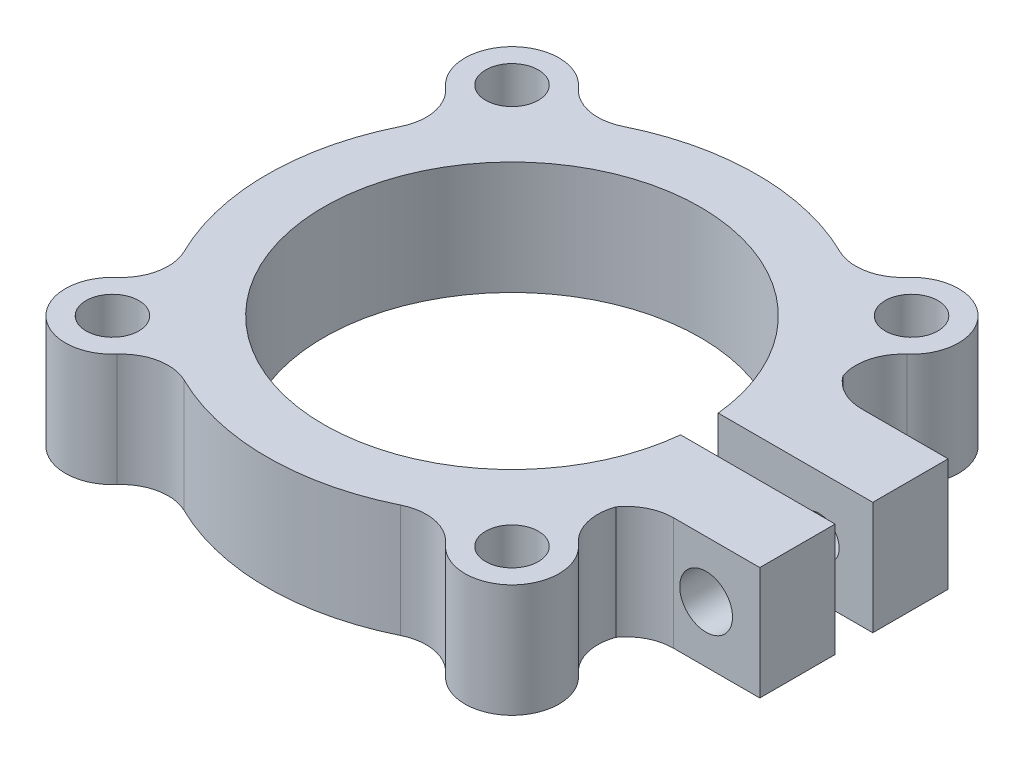
ISO-10303-21;
HEADER;
FILE_DESCRIPTION(('STEP AP214'),'2;1');
FILE_NAME('part.step','',(''),(''),'','','');
FILE_SCHEMA(('AUTOMOTIVE_DESIGN { 1 0 10303 214 1 1 1 1 }'));
ENDSEC;
DATA;
#1=APPLICATION_CONTEXT('core data for automotive mechanical design processes');
#2=APPLICATION_PROTOCOL_DEFINITION('international standard','automotive_design',2000,#1);
#3=PRODUCT_CONTEXT('',#1,'mechanical');
#4=PRODUCT('Part','Part','',(#3));
#5=PRODUCT_RELATED_PRODUCT_CATEGORY('part','',(#4));
#6=PRODUCT_DEFINITION_FORMATION('','',#4);
#7=PRODUCT_DEFINITION_CONTEXT('part definition',#1,'design');
#8=PRODUCT_DEFINITION('design','',#6,#7);
#9=PRODUCT_DEFINITION_SHAPE('','',#8);
#10=(LENGTH_UNIT() NAMED_UNIT(*) SI_UNIT(.MILLI.,.METRE.));
#11=(NAMED_UNIT(*) PLANE_ANGLE_UNIT() SI_UNIT($,.RADIAN.));
#12=(NAMED_UNIT(*) SI_UNIT($,.STERADIAN.) SOLID_ANGLE_UNIT());
#13=UNCERTAINTY_MEASURE_WITH_UNIT(LENGTH_MEASURE(1.E-05),#10,'distance_accuracy_value','');
#14=(GEOMETRIC_REPRESENTATION_CONTEXT(3) GLOBAL_UNCERTAINTY_ASSIGNED_CONTEXT((#13)) GLOBAL_UNIT_ASSIGNED_CONTEXT((#10,
#11,#12)) REPRESENTATION_CONTEXT('',''));
#15=CARTESIAN_POINT('',(0.,0.,0.));
#16=DIRECTION('',(0.,0.,1.));
#17=DIRECTION('',(1.,0.,0.));
#18=AXIS2_PLACEMENT_3D('',#15,#16,#17);
#19=CARTESIAN_POINT('',(19.4387931912541,3.81,6.35));
#20=DIRECTION('',(0.,0.,1.));
#21=DIRECTION('',(1.,0.,0.));
#22=AXIS2_PLACEMENT_3D('',#19,#20,#21);
#23=CYLINDRICAL_SURFACE('',#22,1.77799999999999);
#24=CARTESIAN_POINT('',(19.4387931912541,3.81,1.27));
#25=DIRECTION('',(0.,0.,1.));
#26=DIRECTION('',(1.,0.,0.));
#27=AXIS2_PLACEMENT_3D('',#24,#25,#26);
#28=CIRCLE('',#27,1.77799999999999);
#29=CARTESIAN_POINT('',(21.2167931912541,3.81,1.27));
#30=VERTEX_POINT('',#29);
#31=EDGE_CURVE('E226',#30,#30,#28,.T.);
#32=ORIENTED_EDGE('',*,*,#31,.F.);
#33=EDGE_LOOP('',(#32));
#34=FACE_BOUND('',#33,.T.);
#35=CARTESIAN_POINT('',(19.4387931912541,3.81,6.35000000000001));
#36=DIRECTION('',(0.,0.,1.));
#37=DIRECTION('',(1.,0.,0.));
#38=AXIS2_PLACEMENT_3D('',#35,#36,#37);
#39=CIRCLE('',#38,1.77799999999999);
#40=CARTESIAN_POINT('',(21.2167931912541,3.81,6.35000000000001));
#41=VERTEX_POINT('',#40);
#42=EDGE_CURVE('E231',#41,#41,#39,.F.);
#43=ORIENTED_EDGE('',*,*,#42,.F.);
#44=EDGE_LOOP('',(#43));
#45=FACE_BOUND('',#44,.T.);
#46=ADVANCED_FACE('F17',(#34,#45),#23,.F.);
#47=CARTESIAN_POINT('',(19.4387931912541,3.81,6.35));
#48=DIRECTION('',(0.,0.,1.));
#49=DIRECTION('',(1.,0.,0.));
#50=AXIS2_PLACEMENT_3D('',#47,#48,#49);
#51=CYLINDRICAL_SURFACE('',#50,1.35254999999999);
#52=CARTESIAN_POINT('',(19.4387931912541,3.81,-1.27));
#53=DIRECTION('',(0.,0.,1.));
#54=DIRECTION('',(1.,0.,0.));
#55=AXIS2_PLACEMENT_3D('',#52,#53,#54);
#56=CIRCLE('',#55,1.35254999999999);
#57=CARTESIAN_POINT('',(20.7913431912541,3.81,-1.27));
#58=VERTEX_POINT('',#57);
#59=EDGE_CURVE('E218',#58,#58,#56,.F.);
#60=ORIENTED_EDGE('',*,*,#59,.F.);
#61=EDGE_LOOP('',(#60));
#62=FACE_BOUND('',#61,.T.);
#63=CARTESIAN_POINT('',(19.4387931912541,3.81,-6.35));
#64=DIRECTION('',(0.,0.,1.));
#65=DIRECTION('',(1.,0.,0.));
#66=AXIS2_PLACEMENT_3D('',#63,#64,#65);
#67=CIRCLE('',#66,1.35254999999999);
#68=CARTESIAN_POINT('',(20.7913431912541,3.81,-6.35));
#69=VERTEX_POINT('',#68);
#70=EDGE_CURVE('E20',#69,#69,#67,.T.);
#71=ORIENTED_EDGE('',*,*,#70,.F.);
#72=EDGE_LOOP('',(#71));
#73=FACE_BOUND('',#72,.T.);
#74=ADVANCED_FACE('F736',(#62,#73),#51,.F.);
#75=CARTESIAN_POINT('',(0.,7.62,0.));
#76=DIRECTION('',(0.,1.,0.));
#77=DIRECTION('',(0.,0.,1.));
#78=AXIS2_PLACEMENT_3D('',#75,#76,#77);
#79=PLANE('',#78);
#80=CARTESIAN_POINT('',(13.4703841816036,7.62,-13.4703841816037));
#81=DIRECTION('',(0.,1.,0.));
#82=DIRECTION('',(0.,0.,1.));
#83=AXIS2_PLACEMENT_3D('',#80,#81,#82);
#84=CIRCLE('',#83,1.77799999999999);
#85=CARTESIAN_POINT('',(13.4703841816036,7.62,-11.6923841816037));
#86=VERTEX_POINT('',#85);
#87=EDGE_CURVE('E204',#86,#86,#84,.F.);
#88=ORIENTED_EDGE('',*,*,#87,.T.);
#89=EDGE_LOOP('',(#88));
#90=FACE_BOUND('',#89,.T.);
#91=CARTESIAN_POINT('',(-13.4703841816038,7.62,-13.4703841816036));
#92=DIRECTION('',(0.,1.,0.));
#93=DIRECTION('',(0.,0.,1.));
#94=AXIS2_PLACEMENT_3D('',#91,#92,#93);
#95=CIRCLE('',#94,1.77799999999999);
#96=CARTESIAN_POINT('',(-13.4703841816038,7.62,-11.6923841816036));
#97=VERTEX_POINT('',#96);
#98=EDGE_CURVE('E208',#97,#97,#95,.F.);
#99=ORIENTED_EDGE('',*,*,#98,.T.);
#100=EDGE_LOOP('',(#99));
#101=FACE_BOUND('',#100,.T.);
#102=CARTESIAN_POINT('',(-13.4703841816036,7.62,13.4703841816037));
#103=DIRECTION('',(0.,1.,0.));
#104=DIRECTION('',(0.,0.,1.));
#105=AXIS2_PLACEMENT_3D('',#102,#103,#104);
#106=CIRCLE('',#105,1.77799999999999);
#107=CARTESIAN_POINT('',(-13.4703841816036,7.62,15.2483841816037));
#108=VERTEX_POINT('',#107);
#109=EDGE_CURVE('E211',#108,#108,#106,.F.);
#110=ORIENTED_EDGE('',*,*,#109,.T.);
#111=EDGE_LOOP('',(#110));
#112=FACE_BOUND('',#111,.T.);
#113=CARTESIAN_POINT('',(13.4703841816039,7.62,13.4703841816035));
#114=DIRECTION('',(0.,1.,0.));
#115=DIRECTION('',(0.,0.,1.));
#116=AXIS2_PLACEMENT_3D('',#113,#114,#115);
#117=CIRCLE('',#116,1.77799999999999);
#118=CARTESIAN_POINT('',(13.4703841816039,7.62,15.2483841816035));
#119=VERTEX_POINT('',#118);
#120=EDGE_CURVE('E214',#119,#119,#117,.F.);
#121=ORIENTED_EDGE('',*,*,#120,.T.);
#122=EDGE_LOOP('',(#121));
#123=FACE_BOUND('',#122,.T.);
#124=DIRECTION('',(-1.,0.,0.));
#125=VECTOR('',#124,1.);
#126=CARTESIAN_POINT('',(23.0579604512541,7.62,1.27));
#127=LINE('',#126,#125);
#128=CARTESIAN_POINT('',(12.6363404512541,7.62,1.27));
#129=VERTEX_POINT('',#128);
#130=CARTESIAN_POINT('',(23.0579604512541,7.62,1.27));
#131=VERTEX_POINT('',#130);
#132=EDGE_CURVE('E229',#129,#131,#127,.F.);
#133=ORIENTED_EDGE('',*,*,#132,.F.);
#134=CARTESIAN_POINT('',(0.,7.62,0.));
#135=DIRECTION('',(0.,-1.,0.));
#136=DIRECTION('',(0.,0.,-1.));
#137=AXIS2_PLACEMENT_3D('',#134,#135,#136);
#138=CIRCLE('',#137,12.7);
#139=CARTESIAN_POINT('',(12.6363404512541,7.62,-1.27));
#140=VERTEX_POINT('',#139);
#141=EDGE_CURVE('E222',#129,#140,#138,.T.);
#142=ORIENTED_EDGE('',*,*,#141,.T.);
#143=DIRECTION('',(1.,0.,0.));
#144=VECTOR('',#143,1.);
#145=CARTESIAN_POINT('',(23.0579604512541,7.62,-1.27));
#146=LINE('',#145,#144);
#147=CARTESIAN_POINT('',(23.0579604512541,7.62,-1.27));
#148=VERTEX_POINT('',#147);
#149=EDGE_CURVE('E221',#148,#140,#146,.F.);
#150=ORIENTED_EDGE('',*,*,#149,.F.);
#151=DIRECTION('',(0.,0.,-1.));
#152=VECTOR('',#151,1.);
#153=CARTESIAN_POINT('',(23.0579604512541,7.62,-1.27));
#154=LINE('',#153,#152);
#155=CARTESIAN_POINT('',(23.0579604512541,7.62,-6.35));
#156=VERTEX_POINT('',#155);
#157=EDGE_CURVE('E305',#156,#148,#154,.F.);
#158=ORIENTED_EDGE('',*,*,#157,.F.);
#159=DIRECTION('',(-1.,0.,0.));
#160=VECTOR('',#159,1.);
#161=CARTESIAN_POINT('',(23.0579604512541,7.62,-6.35));
#162=LINE('',#161,#160);
#163=CARTESIAN_POINT('',(17.2271181571382,7.62,-6.35));
#164=VERTEX_POINT('',#163);
#165=EDGE_CURVE('E299',#164,#156,#162,.F.);
#166=ORIENTED_EDGE('',*,*,#165,.F.);
#167=CARTESIAN_POINT('',(17.2271181571382,7.62,-9.525));
#168=DIRECTION('',(0.,-1.,0.));
#169=DIRECTION('',(0.,0.,-1.));
#170=AXIS2_PLACEMENT_3D('',#167,#168,#169);
#171=CIRCLE('',#170,3.175);
#172=CARTESIAN_POINT('',(14.6594904855866,7.62,-7.65740444949055));
#173=VERTEX_POINT('',#172);
#174=EDGE_CURVE('E285',#164,#173,#171,.T.);
#175=ORIENTED_EDGE('',*,*,#174,.T.);
#176=CARTESIAN_POINT('',(17.6591584825056,7.62,-8.69789323283242));
#177=DIRECTION('',(0.,1.,0.));
#178=DIRECTION('',(0.,0.,1.));
#179=AXIS2_PLACEMENT_3D('',#176,#177,#178);
#180=CIRCLE('',#179,3.175);
#181=CARTESIAN_POINT('',(15.5647713320546,7.62,-11.0841387072181));
#182=VERTEX_POINT('',#181);
#183=EDGE_CURVE('E282',#173,#182,#180,.F.);
#184=ORIENTED_EDGE('',*,*,#183,.T.);
#185=CARTESIAN_POINT('',(13.4703841816037,7.62,-13.4703841816038));
#186=DIRECTION('',(0.,-1.,0.));
#187=DIRECTION('',(0.,0.,-1.));
#188=AXIS2_PLACEMENT_3D('',#185,#186,#187);
#189=CIRCLE('',#188,3.17500000000001);
#190=CARTESIAN_POINT('',(11.084138707218,7.62,-15.5647713320547));
#191=VERTEX_POINT('',#190);
#192=EDGE_CURVE('E279',#191,#182,#189,.T.);
#193=ORIENTED_EDGE('',*,*,#192,.F.);
#194=CARTESIAN_POINT('',(8.69789323283236,7.62,-17.6591584825056));
#195=DIRECTION('',(0.,1.,0.));
#196=DIRECTION('',(0.,0.,1.));
#197=AXIS2_PLACEMENT_3D('',#194,#195,#196);
#198=CIRCLE('',#197,3.175);
#199=CARTESIAN_POINT('',(7.29500722753681,7.62,-14.8109071143595));
#200=VERTEX_POINT('',#199);
#201=EDGE_CURVE('E183',#191,#200,#198,.F.);
#202=ORIENTED_EDGE('',*,*,#201,.T.);
#203=CARTESIAN_POINT('',(0.,7.62,0.));
#204=DIRECTION('',(0.,-1.,0.));
#205=DIRECTION('',(0.,0.,-1.));
#206=AXIS2_PLACEMENT_3D('',#203,#204,#205);
#207=CIRCLE('',#206,16.51);
#208=CARTESIAN_POINT('',(-7.29500722753686,7.62,-14.8109071143595));
#209=VERTEX_POINT('',#208);
#210=EDGE_CURVE('E182',#209,#200,#207,.T.);
#211=ORIENTED_EDGE('',*,*,#210,.F.);
#212=CARTESIAN_POINT('',(-8.6978932328324,7.62,-17.6591584825056));
#213=DIRECTION('',(0.,1.,0.));
#214=DIRECTION('',(0.,0.,1.));
#215=AXIS2_PLACEMENT_3D('',#212,#213,#214);
#216=CIRCLE('',#215,3.175);
#217=CARTESIAN_POINT('',(-11.0841387072181,7.62,-15.5647713320546));
#218=VERTEX_POINT('',#217);
#219=EDGE_CURVE('E273',#209,#218,#216,.F.);
#220=ORIENTED_EDGE('',*,*,#219,.T.);
#221=CARTESIAN_POINT('',(-13.4703841816037,7.62,-13.4703841816037));
#222=DIRECTION('',(0.,-1.,0.));
#223=DIRECTION('',(0.,0.,-1.));
#224=AXIS2_PLACEMENT_3D('',#221,#222,#223);
#225=CIRCLE('',#224,3.17500000000001);
#226=CARTESIAN_POINT('',(-15.5647713320547,7.62,-11.084138707218));
#227=VERTEX_POINT('',#226);
#228=EDGE_CURVE('E270',#227,#218,#225,.T.);
#229=ORIENTED_EDGE('',*,*,#228,.F.);
#230=CARTESIAN_POINT('',(-17.6591584825056,7.62,-8.69789323283237));
#231=DIRECTION('',(0.,1.,0.));
#232=DIRECTION('',(0.,0.,1.));
#233=AXIS2_PLACEMENT_3D('',#230,#231,#232);
#234=CIRCLE('',#233,3.175);
#235=CARTESIAN_POINT('',(-14.8109071143595,7.62,-7.29500722753683));
#236=VERTEX_POINT('',#235);
#237=EDGE_CURVE('E266',#227,#236,#234,.F.);
#238=ORIENTED_EDGE('',*,*,#237,.T.);
#239=CARTESIAN_POINT('',(0.,7.62,0.));
#240=DIRECTION('',(0.,-1.,0.));
#241=DIRECTION('',(0.,0.,-1.));
#242=AXIS2_PLACEMENT_3D('',#239,#240,#241);
#243=CIRCLE('',#242,16.51);
#244=CARTESIAN_POINT('',(-14.8109071143595,7.62,7.29500722753685));
#245=VERTEX_POINT('',#244);
#246=EDGE_CURVE('E263',#245,#236,#243,.T.);
#247=ORIENTED_EDGE('',*,*,#246,.F.);
#248=CARTESIAN_POINT('',(-17.6591584825056,7.62,8.6978932328324));
#249=DIRECTION('',(0.,1.,0.));
#250=DIRECTION('',(0.,0.,1.));
#251=AXIS2_PLACEMENT_3D('',#248,#249,#250);
#252=CIRCLE('',#251,3.175);
#253=CARTESIAN_POINT('',(-15.5647713320547,7.62,11.0841387072181));
#254=VERTEX_POINT('',#253);
#255=EDGE_CURVE('E259',#245,#254,#252,.F.);
#256=ORIENTED_EDGE('',*,*,#255,.T.);
#257=CARTESIAN_POINT('',(-13.4703841816037,7.62,13.4703841816037));
#258=DIRECTION('',(0.,-1.,0.));
#259=DIRECTION('',(0.,0.,-1.));
#260=AXIS2_PLACEMENT_3D('',#257,#258,#259);
#261=CIRCLE('',#260,3.17500000000001);
#262=CARTESIAN_POINT('',(-11.0841387072181,7.62,15.5647713320547));
#263=VERTEX_POINT('',#262);
#264=EDGE_CURVE('E256',#263,#254,#261,.T.);
#265=ORIENTED_EDGE('',*,*,#264,.F.);
#266=CARTESIAN_POINT('',(-8.69789323283238,7.62,17.6591584825056));
#267=DIRECTION('',(0.,1.,0.));
#268=DIRECTION('',(0.,0.,1.));
#269=AXIS2_PLACEMENT_3D('',#266,#267,#268);
#270=CIRCLE('',#269,3.175);
#271=CARTESIAN_POINT('',(-7.29500722753683,7.62,14.8109071143595));
#272=VERTEX_POINT('',#271);
#273=EDGE_CURVE('E252',#263,#272,#270,.F.);
#274=ORIENTED_EDGE('',*,*,#273,.T.);
#275=CARTESIAN_POINT('',(0.,7.62,0.));
#276=DIRECTION('',(0.,-1.,0.));
#277=DIRECTION('',(0.,0.,-1.));
#278=AXIS2_PLACEMENT_3D('',#275,#276,#277);
#279=CIRCLE('',#278,16.51);
#280=CARTESIAN_POINT('',(7.29500722753684,7.62,14.8109071143595));
#281=VERTEX_POINT('',#280);
#282=EDGE_CURVE('E249',#281,#272,#279,.T.);
#283=ORIENTED_EDGE('',*,*,#282,.F.);
#284=CARTESIAN_POINT('',(8.69789323283239,7.62,17.6591584825056));
#285=DIRECTION('',(0.,1.,0.));
#286=DIRECTION('',(0.,0.,1.));
#287=AXIS2_PLACEMENT_3D('',#284,#285,#286);
#288=CIRCLE('',#287,3.175);
#289=CARTESIAN_POINT('',(11.0841387072181,7.62,15.5647713320547));
#290=VERTEX_POINT('',#289);
#291=EDGE_CURVE('E245',#281,#290,#288,.F.);
#292=ORIENTED_EDGE('',*,*,#291,.T.);
#293=CARTESIAN_POINT('',(13.4703841816037,7.62,13.4703841816037));
#294=DIRECTION('',(0.,-1.,0.));
#295=DIRECTION('',(0.,0.,-1.));
#296=AXIS2_PLACEMENT_3D('',#293,#294,#295);
#297=CIRCLE('',#296,3.17500000000001);
#298=CARTESIAN_POINT('',(15.5647713320547,7.62,11.0841387072181));
#299=VERTEX_POINT('',#298);
#300=EDGE_CURVE('E243',#299,#290,#297,.T.);
#301=ORIENTED_EDGE('',*,*,#300,.F.);
#302=CARTESIAN_POINT('',(17.6591584825056,7.62,8.69789323283239));
#303=DIRECTION('',(0.,1.,0.));
#304=DIRECTION('',(0.,0.,1.));
#305=AXIS2_PLACEMENT_3D('',#302,#303,#304);
#306=CIRCLE('',#305,3.175);
#307=CARTESIAN_POINT('',(14.6594904855866,7.62,7.65740444949056));
#308=VERTEX_POINT('',#307);
#309=EDGE_CURVE('E239',#299,#308,#306,.F.);
#310=ORIENTED_EDGE('',*,*,#309,.T.);
#311=CARTESIAN_POINT('',(17.2271181571382,7.62,9.525));
#312=DIRECTION('',(0.,-1.,0.));
#313=DIRECTION('',(0.,0.,-1.));
#314=AXIS2_PLACEMENT_3D('',#311,#312,#313);
#315=CIRCLE('',#314,3.175);
#316=CARTESIAN_POINT('',(17.2271181571382,7.62,6.35));
#317=VERTEX_POINT('',#316);
#318=EDGE_CURVE('E235',#308,#317,#315,.T.);
#319=ORIENTED_EDGE('',*,*,#318,.T.);
#320=DIRECTION('',(1.,0.,0.));
#321=VECTOR('',#320,1.);
#322=CARTESIAN_POINT('',(23.0579604512541,7.62,6.35));
#323=LINE('',#322,#321);
#324=CARTESIAN_POINT('',(23.0579604512541,7.62,6.35));
#325=VERTEX_POINT('',#324);
#326=EDGE_CURVE('E234',#325,#317,#323,.F.);
#327=ORIENTED_EDGE('',*,*,#326,.F.);
#328=DIRECTION('',(0.,0.,-1.));
#329=VECTOR('',#328,1.);
#330=CARTESIAN_POINT('',(23.0579604512541,7.62,1.27));
#331=LINE('',#330,#329);
#332=EDGE_CURVE('E319',#131,#325,#331,.F.);
#333=ORIENTED_EDGE('',*,*,#332,.F.);
#334=EDGE_LOOP('',(#133,#142,#150,#158,#166,#175,#184,#193,#202,#211,#220,#229,#238,#247,#256,
#265,#274,#283,#292,#301,#310,#319,#327,#333));
#335=FACE_BOUND('',#334,.T.);
#336=ADVANCED_FACE('F459',(#90,#101,#112,#123,#335),#79,.T.);
#337=CARTESIAN_POINT('',(23.0579604512541,-11.5938157404885,-1.27));
#338=DIRECTION('',(1.,0.,0.));
#339=DIRECTION('',(0.,0.,-1.));
#340=AXIS2_PLACEMENT_3D('',#337,#338,#339);
#341=PLANE('',#340);
#342=ORIENTED_EDGE('',*,*,#157,.T.);
#343=DIRECTION('',(0.,1.,0.));
#344=VECTOR('',#343,1.);
#345=CARTESIAN_POINT('',(23.0579604512541,-11.5938157404885,-1.27));
#346=LINE('',#345,#344);
#347=CARTESIAN_POINT('',(23.0579604512541,0.,-1.27));
#348=VERTEX_POINT('',#347);
#349=EDGE_CURVE('E217',#348,#148,#346,.T.);
#350=ORIENTED_EDGE('',*,*,#349,.F.);
#351=DIRECTION('',(0.,0.,1.));
#352=VECTOR('',#351,1.);
#353=CARTESIAN_POINT('',(23.0579604512541,0.,0.));
#354=LINE('',#353,#352);
#355=CARTESIAN_POINT('',(23.0579604512541,0.,-6.35));
#356=VERTEX_POINT('',#355);
#357=EDGE_CURVE('E207',#348,#356,#354,.F.);
#358=ORIENTED_EDGE('',*,*,#357,.T.);
#359=DIRECTION('',(0.,1.,0.));
#360=VECTOR('',#359,1.);
#361=CARTESIAN_POINT('',(23.0579604512541,-11.5938157404885,-6.35));
#362=LINE('',#361,#360);
#363=EDGE_CURVE('E293',#156,#356,#362,.F.);
#364=ORIENTED_EDGE('',*,*,#363,.F.);
#365=EDGE_LOOP('',(#342,#350,#358,#364));
#366=FACE_BOUND('',#365,.T.);
#367=ADVANCED_FACE('F720',(#366),#341,.T.);
#368=CARTESIAN_POINT('',(23.0579604512541,-11.5938157404885,-6.35));
#369=DIRECTION('',(0.,0.,-1.));
#370=DIRECTION('',(-1.,0.,0.));
#371=AXIS2_PLACEMENT_3D('',#368,#369,#370);
#372=PLANE('',#371);
#373=ORIENTED_EDGE('',*,*,#165,.T.);
#374=ORIENTED_EDGE('',*,*,#363,.T.);
#375=DIRECTION('',(1.,0.,0.));
#376=VECTOR('',#375,1.);
#377=CARTESIAN_POINT('',(0.,0.,-6.35));
#378=LINE('',#377,#376);
#379=CARTESIAN_POINT('',(17.2271181571382,0.,-6.35));
#380=VERTEX_POINT('',#379);
#381=EDGE_CURVE('E203',#356,#380,#378,.F.);
#382=ORIENTED_EDGE('',*,*,#381,.T.);
#383=DIRECTION('',(0.,-1.,0.));
#384=VECTOR('',#383,1.);
#385=CARTESIAN_POINT('',(17.2271181571382,7.62,-6.35));
#386=LINE('',#385,#384);
#387=EDGE_CURVE('E286',#380,#164,#386,.F.);
#388=ORIENTED_EDGE('',*,*,#387,.T.);
#389=EDGE_LOOP('',(#373,#374,#382,#388));
#390=FACE_BOUND('',#389,.T.);
#391=ORIENTED_EDGE('',*,*,#70,.T.);
#392=EDGE_LOOP('',(#391));
#393=FACE_BOUND('',#392,.T.);
#394=ADVANCED_FACE('F407',(#390,#393),#372,.T.);
#395=CARTESIAN_POINT('',(17.2271181571382,7.62,-9.525));
#396=DIRECTION('',(0.,-1.,0.));
#397=DIRECTION('',(0.,0.,-1.));
#398=AXIS2_PLACEMENT_3D('',#395,#396,#397);
#399=CYLINDRICAL_SURFACE('',#398,3.175);
#400=ORIENTED_EDGE('',*,*,#387,.F.);
#401=CARTESIAN_POINT('',(17.2271181571382,0.,-9.525));
#402=DIRECTION('',(0.,-1.,0.));
#403=DIRECTION('',(0.,0.,-1.));
#404=AXIS2_PLACEMENT_3D('',#401,#402,#403);
#405=CIRCLE('',#404,3.175);
#406=CARTESIAN_POINT('',(14.6594904855866,0.,-7.65740444949055));
#407=VERTEX_POINT('',#406);
#408=EDGE_CURVE('E200',#380,#407,#405,.T.);
#409=ORIENTED_EDGE('',*,*,#408,.T.);
#410=DIRECTION('',(0.,1.,0.));
#411=VECTOR('',#410,1.);
#412=CARTESIAN_POINT('',(14.6594904855866,7.62,-7.65740444949055));
#413=LINE('',#412,#411);
#414=EDGE_CURVE('E284',#407,#173,#413,.T.);
#415=ORIENTED_EDGE('',*,*,#414,.T.);
#416=ORIENTED_EDGE('',*,*,#174,.F.);
#417=EDGE_LOOP('',(#400,#409,#415,#416));
#418=FACE_BOUND('',#417,.T.);
#419=ADVANCED_FACE('F403',(#418),#399,.F.);
#420=CARTESIAN_POINT('',(17.6591584825056,7.62,-8.69789323283242));
#421=DIRECTION('',(0.,1.,0.));
#422=DIRECTION('',(0.,0.,1.));
#423=AXIS2_PLACEMENT_3D('',#420,#421,#422);
#424=CYLINDRICAL_SURFACE('',#423,3.175);
#425=ORIENTED_EDGE('',*,*,#183,.F.);
#426=ORIENTED_EDGE('',*,*,#414,.F.);
#427=CARTESIAN_POINT('',(17.6591584825056,0.,-8.69789323283242));
#428=DIRECTION('',(0.,1.,0.));
#429=DIRECTION('',(0.,0.,1.));
#430=AXIS2_PLACEMENT_3D('',#427,#428,#429);
#431=CIRCLE('',#430,3.175);
#432=CARTESIAN_POINT('',(15.5647713320546,0.,-11.0841387072181));
#433=VERTEX_POINT('',#432);
#434=EDGE_CURVE('E197',#407,#433,#431,.F.);
#435=ORIENTED_EDGE('',*,*,#434,.T.);
#436=DIRECTION('',(0.,-1.,0.));
#437=VECTOR('',#436,1.);
#438=CARTESIAN_POINT('',(15.5647713320546,7.62,-11.0841387072181));
#439=LINE('',#438,#437);
#440=EDGE_CURVE('E281',#182,#433,#439,.T.);
#441=ORIENTED_EDGE('',*,*,#440,.F.);
#442=EDGE_LOOP('',(#425,#426,#435,#441));
#443=FACE_BOUND('',#442,.T.);
#444=ADVANCED_FACE('F401',(#443),#424,.F.);
#445=CARTESIAN_POINT('',(13.4703841816037,7.62,-13.4703841816038));
#446=DIRECTION('',(0.,-1.,0.));
#447=DIRECTION('',(0.,0.,-1.));
#448=AXIS2_PLACEMENT_3D('',#445,#446,#447);
#449=CYLINDRICAL_SURFACE('',#448,3.17500000000001);
#450=CARTESIAN_POINT('',(13.4703841816037,0.,-13.4703841816038));
#451=DIRECTION('',(0.,-1.,0.));
#452=DIRECTION('',(0.,0.,-1.));
#453=AXIS2_PLACEMENT_3D('',#450,#451,#452);
#454=CIRCLE('',#453,3.17500000000001);
#455=CARTESIAN_POINT('',(11.084138707218,0.,-15.5647713320547));
#456=VERTEX_POINT('',#455);
#457=EDGE_CURVE('E177',#433,#456,#454,.F.);
#458=ORIENTED_EDGE('',*,*,#457,.T.);
#459=DIRECTION('',(0.,1.,0.));
#460=VECTOR('',#459,1.);
#461=CARTESIAN_POINT('',(11.084138707218,7.62,-15.5647713320547));
#462=LINE('',#461,#460);
#463=EDGE_CURVE('E174',#456,#191,#462,.T.);
#464=ORIENTED_EDGE('',*,*,#463,.T.);
#465=ORIENTED_EDGE('',*,*,#192,.T.);
#466=ORIENTED_EDGE('',*,*,#440,.T.);
#467=EDGE_LOOP('',(#458,#464,#465,#466));
#468=FACE_BOUND('',#467,.T.);
#469=ADVANCED_FACE('F397',(#468),#449,.T.);
#470=CARTESIAN_POINT('',(8.69789323283236,7.62,-17.6591584825056));
#471=DIRECTION('',(0.,1.,0.));
#472=DIRECTION('',(0.,0.,1.));
#473=AXIS2_PLACEMENT_3D('',#470,#471,#472);
#474=CYLINDRICAL_SURFACE('',#473,3.175);
#475=CARTESIAN_POINT('',(8.69789323283236,0.,-17.6591584825056));
#476=DIRECTION('',(0.,1.,0.));
#477=DIRECTION('',(0.,0.,1.));
#478=AXIS2_PLACEMENT_3D('',#475,#476,#477);
#479=CIRCLE('',#478,3.175);
#480=CARTESIAN_POINT('',(7.29500722753681,0.,-14.8109071143595));
#481=VERTEX_POINT('',#480);
#482=EDGE_CURVE('E169',#456,#481,#479,.F.);
#483=ORIENTED_EDGE('',*,*,#482,.T.);
#484=DIRECTION('',(0.,-1.,0.));
#485=VECTOR('',#484,1.);
#486=CARTESIAN_POINT('',(7.29500722753681,7.62,-14.8109071143595));
#487=LINE('',#486,#485);
#488=EDGE_CURVE('E172',#200,#481,#487,.T.);
#489=ORIENTED_EDGE('',*,*,#488,.F.);
#490=ORIENTED_EDGE('',*,*,#201,.F.);
#491=ORIENTED_EDGE('',*,*,#463,.F.);
#492=EDGE_LOOP('',(#483,#489,#490,#491));
#493=FACE_BOUND('',#492,.T.);
#494=ADVANCED_FACE('F170',(#493),#474,.F.);
#495=CARTESIAN_POINT('',(0.,7.62,0.));
#496=DIRECTION('',(0.,-1.,0.));
#497=DIRECTION('',(0.,0.,-1.));
#498=AXIS2_PLACEMENT_3D('',#495,#496,#497);
#499=CYLINDRICAL_SURFACE('',#498,16.51);
#500=CARTESIAN_POINT('',(0.,0.,0.));
#501=DIRECTION('',(0.,-1.,0.));
#502=DIRECTION('',(0.,0.,-1.));
#503=AXIS2_PLACEMENT_3D('',#500,#501,#502);
#504=CIRCLE('',#503,16.51);
#505=CARTESIAN_POINT('',(-7.29500722753686,0.,-14.8109071143595));
#506=VERTEX_POINT('',#505);
#507=EDGE_CURVE('E162',#481,#506,#504,.F.);
#508=ORIENTED_EDGE('',*,*,#507,.T.);
#509=DIRECTION('',(0.,-1.,0.));
#510=VECTOR('',#509,1.);
#511=CARTESIAN_POINT('',(-7.29500722753686,7.62,-14.8109071143595));
#512=LINE('',#511,#510);
#513=EDGE_CURVE('E276',#506,#209,#512,.F.);
#514=ORIENTED_EDGE('',*,*,#513,.T.);
#515=ORIENTED_EDGE('',*,*,#210,.T.);
#516=ORIENTED_EDGE('',*,*,#488,.T.);
#517=EDGE_LOOP('',(#508,#514,#515,#516));
#518=FACE_BOUND('',#517,.T.);
#519=ADVANCED_FACE('F180',(#518),#499,.T.);
#520=CARTESIAN_POINT('',(-8.6978932328324,7.62,-17.6591584825056));
#521=DIRECTION('',(0.,1.,0.));
#522=DIRECTION('',(0.,0.,1.));
#523=AXIS2_PLACEMENT_3D('',#520,#521,#522);
#524=CYLINDRICAL_SURFACE('',#523,3.175);
#525=CARTESIAN_POINT('',(-8.6978932328324,0.,-17.6591584825056));
#526=DIRECTION('',(0.,1.,0.));
#527=DIRECTION('',(0.,0.,1.));
#528=AXIS2_PLACEMENT_3D('',#525,#526,#527);
#529=CIRCLE('',#528,3.175);
#530=CARTESIAN_POINT('',(-11.0841387072181,0.,-15.5647713320546));
#531=VERTEX_POINT('',#530);
#532=EDGE_CURVE('E189',#506,#531,#529,.F.);
#533=ORIENTED_EDGE('',*,*,#532,.T.);
#534=DIRECTION('',(0.,-1.,0.));
#535=VECTOR('',#534,1.);
#536=CARTESIAN_POINT('',(-11.0841387072181,7.62,-15.5647713320546));
#537=LINE('',#536,#535);
#538=EDGE_CURVE('E272',#218,#531,#537,.T.);
#539=ORIENTED_EDGE('',*,*,#538,.F.);
#540=ORIENTED_EDGE('',*,*,#219,.F.);
#541=ORIENTED_EDGE('',*,*,#513,.F.);
#542=EDGE_LOOP('',(#533,#539,#540,#541));
#543=FACE_BOUND('',#542,.T.);
#544=ADVANCED_FACE('F462',(#543),#524,.F.);
#545=CARTESIAN_POINT('',(-13.4703841816037,7.62,-13.4703841816037));
#546=DIRECTION('',(0.,-1.,0.));
#547=DIRECTION('',(0.,0.,-1.));
#548=AXIS2_PLACEMENT_3D('',#545,#546,#547);
#549=CYLINDRICAL_SURFACE('',#548,3.17500000000001);
#550=CARTESIAN_POINT('',(-13.4703841816037,0.,-13.4703841816037));
#551=DIRECTION('',(0.,-1.,0.));
#552=DIRECTION('',(0.,0.,-1.));
#553=AXIS2_PLACEMENT_3D('',#550,#551,#552);
#554=CIRCLE('',#553,3.17500000000001);
#555=CARTESIAN_POINT('',(-15.5647713320547,0.,-11.084138707218));
#556=VERTEX_POINT('',#555);
#557=EDGE_CURVE('E192',#531,#556,#554,.F.);
#558=ORIENTED_EDGE('',*,*,#557,.T.);
#559=DIRECTION('',(0.,1.,0.));
#560=VECTOR('',#559,1.);
#561=CARTESIAN_POINT('',(-15.5647713320547,7.62,-11.084138707218));
#562=LINE('',#561,#560);
#563=EDGE_CURVE('E269',#556,#227,#562,.T.);
#564=ORIENTED_EDGE('',*,*,#563,.T.);
#565=ORIENTED_EDGE('',*,*,#228,.T.);
#566=ORIENTED_EDGE('',*,*,#538,.T.);
#567=EDGE_LOOP('',(#558,#564,#565,#566));
#568=FACE_BOUND('',#567,.T.);
#569=ADVANCED_FACE('F375',(#568),#549,.T.);
#570=CARTESIAN_POINT('',(-17.6591584825056,7.62,-8.69789323283237));
#571=DIRECTION('',(0.,1.,0.));
#572=DIRECTION('',(0.,0.,1.));
#573=AXIS2_PLACEMENT_3D('',#570,#571,#572);
#574=CYLINDRICAL_SURFACE('',#573,3.175);
#575=ORIENTED_EDGE('',*,*,#563,.F.);
#576=CARTESIAN_POINT('',(-17.6591584825056,0.,-8.69789323283237));
#577=DIRECTION('',(0.,1.,0.));
#578=DIRECTION('',(0.,0.,1.));
#579=AXIS2_PLACEMENT_3D('',#576,#577,#578);
#580=CIRCLE('',#579,3.175);
#581=CARTESIAN_POINT('',(-14.8109071143595,0.,-7.29500722753683));
#582=VERTEX_POINT('',#581);
#583=EDGE_CURVE('E370',#556,#582,#580,.F.);
#584=ORIENTED_EDGE('',*,*,#583,.T.);
#585=DIRECTION('',(0.,-1.,0.));
#586=VECTOR('',#585,1.);
#587=CARTESIAN_POINT('',(-14.8109071143595,7.62,-7.29500722753682));
#588=LINE('',#587,#586);
#589=EDGE_CURVE('E265',#236,#582,#588,.T.);
#590=ORIENTED_EDGE('',*,*,#589,.F.);
#591=ORIENTED_EDGE('',*,*,#237,.F.);
#592=EDGE_LOOP('',(#575,#584,#590,#591));
#593=FACE_BOUND('',#592,.T.);
#594=ADVANCED_FACE('F380',(#593),#574,.F.);
#595=CARTESIAN_POINT('',(0.,7.62,0.));
#596=DIRECTION('',(0.,-1.,0.));
#597=DIRECTION('',(0.,0.,-1.));
#598=AXIS2_PLACEMENT_3D('',#595,#596,#597);
#599=CYLINDRICAL_SURFACE('',#598,16.51);
#600=ORIENTED_EDGE('',*,*,#246,.T.);
#601=ORIENTED_EDGE('',*,*,#589,.T.);
#602=CARTESIAN_POINT('',(0.,0.,0.));
#603=DIRECTION('',(0.,-1.,0.));
#604=DIRECTION('',(0.,0.,-1.));
#605=AXIS2_PLACEMENT_3D('',#602,#603,#604);
#606=CIRCLE('',#605,16.51);
#607=CARTESIAN_POINT('',(-14.8109071143595,0.,7.29500722753685));
#608=VERTEX_POINT('',#607);
#609=EDGE_CURVE('E367',#582,#608,#606,.F.);
#610=ORIENTED_EDGE('',*,*,#609,.T.);
#611=DIRECTION('',(0.,1.,0.));
#612=VECTOR('',#611,1.);
#613=CARTESIAN_POINT('',(-14.8109071143595,7.62,7.29500722753685));
#614=LINE('',#613,#612);
#615=EDGE_CURVE('E262',#608,#245,#614,.T.);
#616=ORIENTED_EDGE('',*,*,#615,.T.);
#617=EDGE_LOOP('',(#600,#601,#610,#616));
#618=FACE_BOUND('',#617,.T.);
#619=ADVANCED_FACE('F388',(#618),#599,.T.);
#620=CARTESIAN_POINT('',(-17.6591584825056,7.62,8.6978932328324));
#621=DIRECTION('',(0.,1.,0.));
#622=DIRECTION('',(0.,0.,1.));
#623=AXIS2_PLACEMENT_3D('',#620,#621,#622);
#624=CYLINDRICAL_SURFACE('',#623,3.175);
#625=ORIENTED_EDGE('',*,*,#615,.F.);
#626=CARTESIAN_POINT('',(-17.6591584825056,0.,8.6978932328324));
#627=DIRECTION('',(0.,1.,0.));
#628=DIRECTION('',(0.,0.,1.));
#629=AXIS2_PLACEMENT_3D('',#626,#627,#628);
#630=CIRCLE('',#629,3.175);
#631=CARTESIAN_POINT('',(-15.5647713320547,0.,11.0841387072181));
#632=VERTEX_POINT('',#631);
#633=EDGE_CURVE('E364',#608,#632,#630,.F.);
#634=ORIENTED_EDGE('',*,*,#633,.T.);
#635=DIRECTION('',(0.,-1.,0.));
#636=VECTOR('',#635,1.);
#637=CARTESIAN_POINT('',(-15.5647713320547,7.62,11.0841387072181));
#638=LINE('',#637,#636);
#639=EDGE_CURVE('E258',#254,#632,#638,.T.);
#640=ORIENTED_EDGE('',*,*,#639,.F.);
#641=ORIENTED_EDGE('',*,*,#255,.F.);
#642=EDGE_LOOP('',(#625,#634,#640,#641));
#643=FACE_BOUND('',#642,.T.);
#644=ADVANCED_FACE('F457',(#643),#624,.F.);
#645=CARTESIAN_POINT('',(-13.4703841816037,7.62,13.4703841816037));
#646=DIRECTION('',(0.,-1.,0.));
#647=DIRECTION('',(0.,0.,-1.));
#648=AXIS2_PLACEMENT_3D('',#645,#646,#647);
#649=CYLINDRICAL_SURFACE('',#648,3.17500000000001);
#650=CARTESIAN_POINT('',(-13.4703841816037,0.,13.4703841816037));
#651=DIRECTION('',(0.,-1.,0.));
#652=DIRECTION('',(0.,0.,-1.));
#653=AXIS2_PLACEMENT_3D('',#650,#651,#652);
#654=CIRCLE('',#653,3.17500000000001);
#655=CARTESIAN_POINT('',(-11.0841387072181,0.,15.5647713320547));
#656=VERTEX_POINT('',#655);
#657=EDGE_CURVE('E361',#632,#656,#654,.F.);
#658=ORIENTED_EDGE('',*,*,#657,.T.);
#659=DIRECTION('',(0.,1.,0.));
#660=VECTOR('',#659,1.);
#661=CARTESIAN_POINT('',(-11.0841387072181,7.62,15.5647713320547));
#662=LINE('',#661,#660);
#663=EDGE_CURVE('E255',#656,#263,#662,.T.);
#664=ORIENTED_EDGE('',*,*,#663,.T.);
#665=ORIENTED_EDGE('',*,*,#264,.T.);
#666=ORIENTED_EDGE('',*,*,#639,.T.);
#667=EDGE_LOOP('',(#658,#664,#665,#666));
#668=FACE_BOUND('',#667,.T.);
#669=ADVANCED_FACE('F452',(#668),#649,.T.);
#670=CARTESIAN_POINT('',(-8.69789323283238,7.62,17.6591584825056));
#671=DIRECTION('',(0.,1.,0.));
#672=DIRECTION('',(0.,0.,1.));
#673=AXIS2_PLACEMENT_3D('',#670,#671,#672);
#674=CYLINDRICAL_SURFACE('',#673,3.175);
#675=ORIENTED_EDGE('',*,*,#663,.F.);
#676=CARTESIAN_POINT('',(-8.69789323283238,0.,17.6591584825056));
#677=DIRECTION('',(0.,1.,0.));
#678=DIRECTION('',(0.,0.,1.));
#679=AXIS2_PLACEMENT_3D('',#676,#677,#678);
#680=CIRCLE('',#679,3.175);
#681=CARTESIAN_POINT('',(-7.29500722753683,0.,14.8109071143595));
#682=VERTEX_POINT('',#681);
#683=EDGE_CURVE('E358',#656,#682,#680,.F.);
#684=ORIENTED_EDGE('',*,*,#683,.T.);
#685=DIRECTION('',(0.,-1.,0.));
#686=VECTOR('',#685,1.);
#687=CARTESIAN_POINT('',(-7.29500722753683,7.62,14.8109071143595));
#688=LINE('',#687,#686);
#689=EDGE_CURVE('E251',#272,#682,#688,.T.);
#690=ORIENTED_EDGE('',*,*,#689,.F.);
#691=ORIENTED_EDGE('',*,*,#273,.F.);
#692=EDGE_LOOP('',(#675,#684,#690,#691));
#693=FACE_BOUND('',#692,.T.);
#694=ADVANCED_FACE('F534',(#693),#674,.F.);
#695=CARTESIAN_POINT('',(0.,7.62,0.));
#696=DIRECTION('',(0.,-1.,0.));
#697=DIRECTION('',(0.,0.,-1.));
#698=AXIS2_PLACEMENT_3D('',#695,#696,#697);
#699=CYLINDRICAL_SURFACE('',#698,16.51);
#700=ORIENTED_EDGE('',*,*,#282,.T.);
#701=ORIENTED_EDGE('',*,*,#689,.T.);
#702=CARTESIAN_POINT('',(0.,0.,0.));
#703=DIRECTION('',(0.,-1.,0.));
#704=DIRECTION('',(0.,0.,-1.));
#705=AXIS2_PLACEMENT_3D('',#702,#703,#704);
#706=CIRCLE('',#705,16.51);
#707=CARTESIAN_POINT('',(7.29500722753684,0.,14.8109071143595));
#708=VERTEX_POINT('',#707);
#709=EDGE_CURVE('E355',#682,#708,#706,.F.);
#710=ORIENTED_EDGE('',*,*,#709,.T.);
#711=DIRECTION('',(0.,1.,0.));
#712=VECTOR('',#711,1.);
#713=CARTESIAN_POINT('',(7.29500722753684,7.62,14.8109071143595));
#714=LINE('',#713,#712);
#715=EDGE_CURVE('E248',#708,#281,#714,.T.);
#716=ORIENTED_EDGE('',*,*,#715,.T.);
#717=EDGE_LOOP('',(#700,#701,#710,#716));
#718=FACE_BOUND('',#717,.T.);
#719=ADVANCED_FACE('F530',(#718),#699,.T.);
#720=CARTESIAN_POINT('',(8.69789323283239,7.62,17.6591584825056));
#721=DIRECTION('',(0.,1.,0.));
#722=DIRECTION('',(0.,0.,1.));
#723=AXIS2_PLACEMENT_3D('',#720,#721,#722);
#724=CYLINDRICAL_SURFACE('',#723,3.175);
#725=ORIENTED_EDGE('',*,*,#715,.F.);
#726=CARTESIAN_POINT('',(8.69789323283239,0.,17.6591584825056));
#727=DIRECTION('',(0.,1.,0.));
#728=DIRECTION('',(0.,0.,1.));
#729=AXIS2_PLACEMENT_3D('',#726,#727,#728);
#730=CIRCLE('',#729,3.175);
#731=CARTESIAN_POINT('',(11.0841387072181,0.,15.5647713320547));
#732=VERTEX_POINT('',#731);
#733=EDGE_CURVE('E352',#708,#732,#730,.F.);
#734=ORIENTED_EDGE('',*,*,#733,.T.);
#735=DIRECTION('',(0.,-1.,0.));
#736=VECTOR('',#735,1.);
#737=CARTESIAN_POINT('',(11.0841387072181,7.62,15.5647713320547));
#738=LINE('',#737,#736);
#739=EDGE_CURVE('E242',#290,#732,#738,.T.);
#740=ORIENTED_EDGE('',*,*,#739,.F.);
#741=ORIENTED_EDGE('',*,*,#291,.F.);
#742=EDGE_LOOP('',(#725,#734,#740,#741));
#743=FACE_BOUND('',#742,.T.);
#744=ADVANCED_FACE('F526',(#743),#724,.F.);
#745=CARTESIAN_POINT('',(13.4703841816037,7.62,13.4703841816037));
#746=DIRECTION('',(0.,-1.,0.));
#747=DIRECTION('',(0.,0.,-1.));
#748=AXIS2_PLACEMENT_3D('',#745,#746,#747);
#749=CYLINDRICAL_SURFACE('',#748,3.17500000000001);
#750=ORIENTED_EDGE('',*,*,#300,.T.);
#751=ORIENTED_EDGE('',*,*,#739,.T.);
#752=CARTESIAN_POINT('',(13.4703841816037,0.,13.4703841816037));
#753=DIRECTION('',(0.,-1.,0.));
#754=DIRECTION('',(0.,0.,-1.));
#755=AXIS2_PLACEMENT_3D('',#752,#753,#754);
#756=CIRCLE('',#755,3.17500000000001);
#757=CARTESIAN_POINT('',(15.5647713320547,0.,11.0841387072181));
#758=VERTEX_POINT('',#757);
#759=EDGE_CURVE('E349',#732,#758,#756,.F.);
#760=ORIENTED_EDGE('',*,*,#759,.T.);
#761=DIRECTION('',(0.,1.,0.));
#762=VECTOR('',#761,1.);
#763=CARTESIAN_POINT('',(15.5647713320547,7.62,11.0841387072181));
#764=LINE('',#763,#762);
#765=EDGE_CURVE('E241',#758,#299,#764,.T.);
#766=ORIENTED_EDGE('',*,*,#765,.T.);
#767=EDGE_LOOP('',(#750,#751,#760,#766));
#768=FACE_BOUND('',#767,.T.);
#769=ADVANCED_FACE('F522',(#768),#749,.T.);
#770=CARTESIAN_POINT('',(17.6591584825056,7.62,8.69789323283239));
#771=DIRECTION('',(0.,1.,0.));
#772=DIRECTION('',(0.,0.,1.));
#773=AXIS2_PLACEMENT_3D('',#770,#771,#772);
#774=CYLINDRICAL_SURFACE('',#773,3.175);
#775=CARTESIAN_POINT('',(17.6591584825056,0.,8.69789323283239));
#776=DIRECTION('',(0.,1.,0.));
#777=DIRECTION('',(0.,0.,1.));
#778=AXIS2_PLACEMENT_3D('',#775,#776,#777);
#779=CIRCLE('',#778,3.175);
#780=CARTESIAN_POINT('',(14.6594904855866,0.,7.65740444949056));
#781=VERTEX_POINT('',#780);
#782=EDGE_CURVE('E346',#758,#781,#779,.F.);
#783=ORIENTED_EDGE('',*,*,#782,.T.);
#784=DIRECTION('',(0.,-1.,0.));
#785=VECTOR('',#784,1.);
#786=CARTESIAN_POINT('',(14.6594904855866,7.62,7.65740444949056));
#787=LINE('',#786,#785);
#788=EDGE_CURVE('E238',#781,#308,#787,.F.);
#789=ORIENTED_EDGE('',*,*,#788,.T.);
#790=ORIENTED_EDGE('',*,*,#309,.F.);
#791=ORIENTED_EDGE('',*,*,#765,.F.);
#792=EDGE_LOOP('',(#783,#789,#790,#791));
#793=FACE_BOUND('',#792,.T.);
#794=ADVANCED_FACE('F518',(#793),#774,.F.);
#795=CARTESIAN_POINT('',(17.2271181571382,7.62,9.525));
#796=DIRECTION('',(0.,-1.,0.));
#797=DIRECTION('',(0.,0.,-1.));
#798=AXIS2_PLACEMENT_3D('',#795,#796,#797);
#799=CYLINDRICAL_SURFACE('',#798,3.175);
#800=DIRECTION('',(0.,1.,0.));
#801=VECTOR('',#800,1.);
#802=CARTESIAN_POINT('',(17.2271181571382,-11.5938157404885,6.35));
#803=LINE('',#802,#801);
#804=CARTESIAN_POINT('',(17.2271181571382,0.,6.35));
#805=VERTEX_POINT('',#804);
#806=EDGE_CURVE('E322',#317,#805,#803,.F.);
#807=ORIENTED_EDGE('',*,*,#806,.F.);
#808=ORIENTED_EDGE('',*,*,#318,.F.);
#809=ORIENTED_EDGE('',*,*,#788,.F.);
#810=CARTESIAN_POINT('',(17.2271181571382,0.,9.525));
#811=DIRECTION('',(0.,-1.,0.));
#812=DIRECTION('',(0.,0.,-1.));
#813=AXIS2_PLACEMENT_3D('',#810,#811,#812);
#814=CIRCLE('',#813,3.175);
#815=EDGE_CURVE('E342',#781,#805,#814,.T.);
#816=ORIENTED_EDGE('',*,*,#815,.T.);
#817=EDGE_LOOP('',(#807,#808,#809,#816));
#818=FACE_BOUND('',#817,.T.);
#819=ADVANCED_FACE('F514',(#818),#799,.F.);
#820=CARTESIAN_POINT('',(23.0579604512541,-11.5938157404885,6.35));
#821=DIRECTION('',(0.,0.,1.));
#822=DIRECTION('',(1.,0.,0.));
#823=AXIS2_PLACEMENT_3D('',#820,#821,#822);
#824=PLANE('',#823);
#825=DIRECTION('',(1.,0.,0.));
#826=VECTOR('',#825,1.);
#827=CARTESIAN_POINT('',(0.,0.,6.35));
#828=LINE('',#827,#826);
#829=CARTESIAN_POINT('',(23.0579604512541,0.,6.35));
#830=VERTEX_POINT('',#829);
#831=EDGE_CURVE('E345',#805,#830,#828,.T.);
#832=ORIENTED_EDGE('',*,*,#831,.T.);
#833=DIRECTION('',(0.,1.,0.));
#834=VECTOR('',#833,1.);
#835=CARTESIAN_POINT('',(23.0579604512541,-11.5938157404885,6.35));
#836=LINE('',#835,#834);
#837=EDGE_CURVE('E230',#325,#830,#836,.F.);
#838=ORIENTED_EDGE('',*,*,#837,.F.);
#839=ORIENTED_EDGE('',*,*,#326,.T.);
#840=ORIENTED_EDGE('',*,*,#806,.T.);
#841=EDGE_LOOP('',(#832,#838,#839,#840));
#842=FACE_BOUND('',#841,.T.);
#843=ORIENTED_EDGE('',*,*,#42,.T.);
#844=EDGE_LOOP('',(#843));
#845=FACE_BOUND('',#844,.T.);
#846=ADVANCED_FACE('F510',(#842,#845),#824,.T.);
#847=CARTESIAN_POINT('',(23.0579604512541,-11.5938157404885,1.27));
#848=DIRECTION('',(1.,0.,0.));
#849=DIRECTION('',(0.,0.,-1.));
#850=AXIS2_PLACEMENT_3D('',#847,#848,#849);
#851=PLANE('',#850);
#852=ORIENTED_EDGE('',*,*,#332,.T.);
#853=ORIENTED_EDGE('',*,*,#837,.T.);
#854=DIRECTION('',(0.,0.,1.));
#855=VECTOR('',#854,1.);
#856=CARTESIAN_POINT('',(23.0579604512541,0.,0.));
#857=LINE('',#856,#855);
#858=CARTESIAN_POINT('',(23.0579604512541,0.,1.27));
#859=VERTEX_POINT('',#858);
#860=EDGE_CURVE('E431',#830,#859,#857,.F.);
#861=ORIENTED_EDGE('',*,*,#860,.T.);
#862=DIRECTION('',(0.,1.,0.));
#863=VECTOR('',#862,1.);
#864=CARTESIAN_POINT('',(23.0579604512541,-11.5938157404885,1.27));
#865=LINE('',#864,#863);
#866=EDGE_CURVE('E316',#131,#859,#865,.F.);
#867=ORIENTED_EDGE('',*,*,#866,.F.);
#868=EDGE_LOOP('',(#852,#853,#861,#867));
#869=FACE_BOUND('',#868,.T.);
#870=ADVANCED_FACE('F506',(#869),#851,.T.);
#871=CARTESIAN_POINT('',(23.0579604512541,-11.5938157404885,1.27));
#872=DIRECTION('',(0.,0.,-1.));
#873=DIRECTION('',(-1.,0.,0.));
#874=AXIS2_PLACEMENT_3D('',#871,#872,#873);
#875=PLANE('',#874);
#876=ORIENTED_EDGE('',*,*,#132,.T.);
#877=ORIENTED_EDGE('',*,*,#866,.T.);
#878=DIRECTION('',(1.,0.,0.));
#879=VECTOR('',#878,1.);
#880=CARTESIAN_POINT('',(0.,0.,1.27));
#881=LINE('',#880,#879);
#882=CARTESIAN_POINT('',(12.6363404512541,0.,1.27));
#883=VERTEX_POINT('',#882);
#884=EDGE_CURVE('E341',#859,#883,#881,.F.);
#885=ORIENTED_EDGE('',*,*,#884,.T.);
#886=DIRECTION('',(0.,-1.,0.));
#887=VECTOR('',#886,1.);
#888=CARTESIAN_POINT('',(12.6363404512541,7.62,1.27));
#889=LINE('',#888,#887);
#890=EDGE_CURVE('E225',#883,#129,#889,.F.);
#891=ORIENTED_EDGE('',*,*,#890,.T.);
#892=EDGE_LOOP('',(#876,#877,#885,#891));
#893=FACE_BOUND('',#892,.T.);
#894=ORIENTED_EDGE('',*,*,#31,.T.);
#895=EDGE_LOOP('',(#894));
#896=FACE_BOUND('',#895,.T.);
#897=ADVANCED_FACE('F503',(#893,#896),#875,.T.);
#898=CARTESIAN_POINT('',(0.,7.62,0.));
#899=DIRECTION('',(0.,-1.,0.));
#900=DIRECTION('',(0.,0.,-1.));
#901=AXIS2_PLACEMENT_3D('',#898,#899,#900);
#902=CYLINDRICAL_SURFACE('',#901,12.7);
#903=ORIENTED_EDGE('',*,*,#141,.F.);
#904=ORIENTED_EDGE('',*,*,#890,.F.);
#905=CARTESIAN_POINT('',(0.,0.,0.));
#906=DIRECTION('',(0.,-1.,0.));
#907=DIRECTION('',(0.,0.,-1.));
#908=AXIS2_PLACEMENT_3D('',#905,#906,#907);
#909=CIRCLE('',#908,12.7);
#910=CARTESIAN_POINT('',(12.6363404512541,0.,-1.27));
#911=VERTEX_POINT('',#910);
#912=EDGE_CURVE('E35',#883,#911,#909,.T.);
#913=ORIENTED_EDGE('',*,*,#912,.T.);
#914=DIRECTION('',(0.,1.,0.));
#915=VECTOR('',#914,1.);
#916=CARTESIAN_POINT('',(12.6363404512541,-11.5938157404885,-1.27));
#917=LINE('',#916,#915);
#918=EDGE_CURVE('E311',#140,#911,#917,.F.);
#919=ORIENTED_EDGE('',*,*,#918,.F.);
#920=EDGE_LOOP('',(#903,#904,#913,#919));
#921=FACE_BOUND('',#920,.T.);
#922=ADVANCED_FACE('F499',(#921),#902,.F.);
#923=CARTESIAN_POINT('',(23.0579604512541,-11.5938157404885,-1.27));
#924=DIRECTION('',(0.,0.,1.));
#925=DIRECTION('',(1.,0.,0.));
#926=AXIS2_PLACEMENT_3D('',#923,#924,#925);
#927=PLANE('',#926);
#928=DIRECTION('',(1.,0.,0.));
#929=VECTOR('',#928,1.);
#930=CARTESIAN_POINT('',(0.,0.,-1.27));
#931=LINE('',#930,#929);
#932=EDGE_CURVE('E339',#911,#348,#931,.T.);
#933=ORIENTED_EDGE('',*,*,#932,.T.);
#934=ORIENTED_EDGE('',*,*,#349,.T.);
#935=ORIENTED_EDGE('',*,*,#149,.T.);
#936=ORIENTED_EDGE('',*,*,#918,.T.);
#937=EDGE_LOOP('',(#933,#934,#935,#936));
#938=FACE_BOUND('',#937,.T.);
#939=ORIENTED_EDGE('',*,*,#59,.T.);
#940=EDGE_LOOP('',(#939));
#941=FACE_BOUND('',#940,.T.);
#942=ADVANCED_FACE('F495',(#938,#941),#927,.T.);
#943=CARTESIAN_POINT('',(13.4703841816039,7.62,13.4703841816035));
#944=DIRECTION('',(0.,1.,0.));
#945=DIRECTION('',(0.,0.,1.));
#946=AXIS2_PLACEMENT_3D('',#943,#944,#945);
#947=CYLINDRICAL_SURFACE('',#946,1.77799999999999);
#948=CARTESIAN_POINT('',(13.4703841816039,0.,13.4703841816035));
#949=DIRECTION('',(0.,1.,0.));
#950=DIRECTION('',(0.,0.,1.));
#951=AXIS2_PLACEMENT_3D('',#948,#949,#950);
#952=CIRCLE('',#951,1.77799999999999);
#953=CARTESIAN_POINT('',(13.4703841816039,0.,15.2483841816035));
#954=VERTEX_POINT('',#953);
#955=EDGE_CURVE('E336',#954,#954,#952,.F.);
#956=ORIENTED_EDGE('',*,*,#955,.T.);
#957=EDGE_LOOP('',(#956));
#958=FACE_BOUND('',#957,.T.);
#959=ORIENTED_EDGE('',*,*,#120,.F.);
#960=EDGE_LOOP('',(#959));
#961=FACE_BOUND('',#960,.T.);
#962=ADVANCED_FACE('F491',(#958,#961),#947,.F.);
#963=CARTESIAN_POINT('',(-13.4703841816036,7.62,13.4703841816037));
#964=DIRECTION('',(0.,1.,0.));
#965=DIRECTION('',(0.,0.,1.));
#966=AXIS2_PLACEMENT_3D('',#963,#964,#965);
#967=CYLINDRICAL_SURFACE('',#966,1.77799999999999);
#968=CARTESIAN_POINT('',(-13.4703841816036,0.,13.4703841816037));
#969=DIRECTION('',(0.,1.,0.));
#970=DIRECTION('',(0.,0.,1.));
#971=AXIS2_PLACEMENT_3D('',#968,#969,#970);
#972=CIRCLE('',#971,1.77799999999999);
#973=CARTESIAN_POINT('',(-13.4703841816036,0.,15.2483841816037));
#974=VERTEX_POINT('',#973);
#975=EDGE_CURVE('E333',#974,#974,#972,.F.);
#976=ORIENTED_EDGE('',*,*,#975,.T.);
#977=EDGE_LOOP('',(#976));
#978=FACE_BOUND('',#977,.T.);
#979=ORIENTED_EDGE('',*,*,#109,.F.);
#980=EDGE_LOOP('',(#979));
#981=FACE_BOUND('',#980,.T.);
#982=ADVANCED_FACE('F487',(#978,#981),#967,.F.);
#983=CARTESIAN_POINT('',(-13.4703841816038,7.62,-13.4703841816036));
#984=DIRECTION('',(0.,1.,0.));
#985=DIRECTION('',(0.,0.,1.));
#986=AXIS2_PLACEMENT_3D('',#983,#984,#985);
#987=CYLINDRICAL_SURFACE('',#986,1.77799999999999);
#988=CARTESIAN_POINT('',(-13.4703841816038,0.,-13.4703841816036));
#989=DIRECTION('',(0.,1.,0.));
#990=DIRECTION('',(0.,0.,1.));
#991=AXIS2_PLACEMENT_3D('',#988,#989,#990);
#992=CIRCLE('',#991,1.77799999999999);
#993=CARTESIAN_POINT('',(-13.4703841816038,0.,-11.6923841816036));
#994=VERTEX_POINT('',#993);
#995=EDGE_CURVE('E26',#994,#994,#992,.F.);
#996=ORIENTED_EDGE('',*,*,#995,.T.);
#997=EDGE_LOOP('',(#996));
#998=FACE_BOUND('',#997,.T.);
#999=ORIENTED_EDGE('',*,*,#98,.F.);
#1000=EDGE_LOOP('',(#999));
#1001=FACE_BOUND('',#1000,.T.);
#1002=ADVANCED_FACE('F479',(#998,#1001),#987,.F.);
#1003=CARTESIAN_POINT('',(13.4703841816036,7.62,-13.4703841816037));
#1004=DIRECTION('',(0.,1.,0.));
#1005=DIRECTION('',(0.,0.,1.));
#1006=AXIS2_PLACEMENT_3D('',#1003,#1004,#1005);
#1007=CYLINDRICAL_SURFACE('',#1006,1.77799999999999);
#1008=CARTESIAN_POINT('',(13.4703841816036,0.,-13.4703841816037));
#1009=DIRECTION('',(0.,1.,0.));
#1010=DIRECTION('',(0.,0.,1.));
#1011=AXIS2_PLACEMENT_3D('',#1008,#1009,#1010);
#1012=CIRCLE('',#1011,1.77799999999999);
#1013=CARTESIAN_POINT('',(13.4703841816036,0.,-11.6923841816037));
#1014=VERTEX_POINT('',#1013);
#1015=EDGE_CURVE('E10',#1014,#1014,#1012,.F.);
#1016=ORIENTED_EDGE('',*,*,#1015,.T.);
#1017=EDGE_LOOP('',(#1016));
#1018=FACE_BOUND('',#1017,.T.);
#1019=ORIENTED_EDGE('',*,*,#87,.F.);
#1020=EDGE_LOOP('',(#1019));
#1021=FACE_BOUND('',#1020,.T.);
#1022=ADVANCED_FACE('F473',(#1018,#1021),#1007,.F.);
#1023=CARTESIAN_POINT('',(0.,0.,0.));
#1024=DIRECTION('',(0.,1.,0.));
#1025=DIRECTION('',(0.,0.,1.));
#1026=AXIS2_PLACEMENT_3D('',#1023,#1024,#1025);
#1027=PLANE('',#1026);
#1028=ORIENTED_EDGE('',*,*,#1015,.F.);
#1029=EDGE_LOOP('',(#1028));
#1030=FACE_BOUND('',#1029,.T.);
#1031=ORIENTED_EDGE('',*,*,#995,.F.);
#1032=EDGE_LOOP('',(#1031));
#1033=FACE_BOUND('',#1032,.T.);
#1034=ORIENTED_EDGE('',*,*,#975,.F.);
#1035=EDGE_LOOP('',(#1034));
#1036=FACE_BOUND('',#1035,.T.);
#1037=ORIENTED_EDGE('',*,*,#955,.F.);
#1038=EDGE_LOOP('',(#1037));
#1039=FACE_BOUND('',#1038,.T.);
#1040=ORIENTED_EDGE('',*,*,#932,.F.);
#1041=ORIENTED_EDGE('',*,*,#912,.F.);
#1042=ORIENTED_EDGE('',*,*,#884,.F.);
#1043=ORIENTED_EDGE('',*,*,#860,.F.);
#1044=ORIENTED_EDGE('',*,*,#831,.F.);
#1045=ORIENTED_EDGE('',*,*,#815,.F.);
#1046=ORIENTED_EDGE('',*,*,#782,.F.);
#1047=ORIENTED_EDGE('',*,*,#759,.F.);
#1048=ORIENTED_EDGE('',*,*,#733,.F.);
#1049=ORIENTED_EDGE('',*,*,#709,.F.);
#1050=ORIENTED_EDGE('',*,*,#683,.F.);
#1051=ORIENTED_EDGE('',*,*,#657,.F.);
#1052=ORIENTED_EDGE('',*,*,#633,.F.);
#1053=ORIENTED_EDGE('',*,*,#609,.F.);
#1054=ORIENTED_EDGE('',*,*,#583,.F.);
#1055=ORIENTED_EDGE('',*,*,#557,.F.);
#1056=ORIENTED_EDGE('',*,*,#532,.F.);
#1057=ORIENTED_EDGE('',*,*,#507,.F.);
#1058=ORIENTED_EDGE('',*,*,#482,.F.);
#1059=ORIENTED_EDGE('',*,*,#457,.F.);
#1060=ORIENTED_EDGE('',*,*,#434,.F.);
#1061=ORIENTED_EDGE('',*,*,#408,.F.);
#1062=ORIENTED_EDGE('',*,*,#381,.F.);
#1063=ORIENTED_EDGE('',*,*,#357,.F.);
#1064=EDGE_LOOP('',(#1040,#1041,#1042,#1043,#1044,#1045,#1046,#1047,#1048,#1049,#1050,#1051,
#1052,#1053,#1054,#1055,#1056,#1057,#1058,#1059,#1060,#1061,#1062,#1063));
#1065=FACE_BOUND('',#1064,.T.);
#1066=ADVANCED_FACE('F186',(#1030,#1033,#1036,#1039,#1065),#1027,.F.);
#1067=CLOSED_SHELL('',(#46,#74,#336,#367,#394,#419,#444,#469,#494,#519,#544,#569,#594,#619,#644,
#669,#694,#719,#744,#769,#794,#819,#846,#870,#897,#922,#942,#962,#982,#1002,#1022,#1066));
#1068=MANIFOLD_SOLID_BREP('B1',#1067);
#1069=ADVANCED_BREP_SHAPE_REPRESENTATION('',(#18,#1068),#14);
#1070=SHAPE_DEFINITION_REPRESENTATION(#9,#1069);
ENDSEC;
END-ISO-10303-21;
